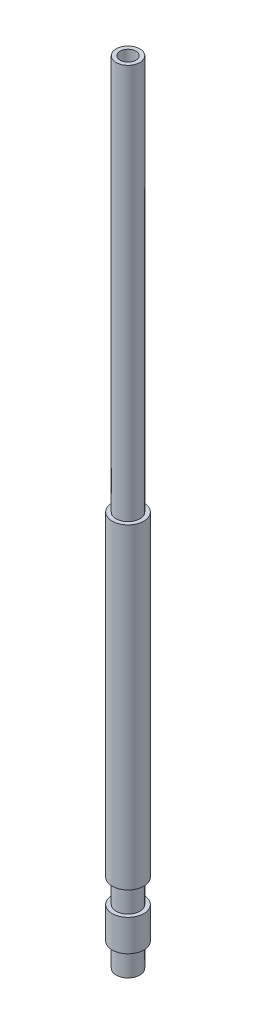
ISO-10303-21;
HEADER;
FILE_DESCRIPTION(('STEP AP214'),'2;1');
FILE_NAME('part.step','',(''),(''),'','','');
FILE_SCHEMA(('AUTOMOTIVE_DESIGN { 1 0 10303 214 1 1 1 1 }'));
ENDSEC;
DATA;
#1=APPLICATION_CONTEXT('core data for automotive mechanical design processes');
#2=APPLICATION_PROTOCOL_DEFINITION('international standard','automotive_design',2000,#1);
#3=PRODUCT_CONTEXT('',#1,'mechanical');
#4=PRODUCT('Part','Part','',(#3));
#5=PRODUCT_RELATED_PRODUCT_CATEGORY('part','',(#4));
#6=PRODUCT_DEFINITION_FORMATION('','',#4);
#7=PRODUCT_DEFINITION_CONTEXT('part definition',#1,'design');
#8=PRODUCT_DEFINITION('design','',#6,#7);
#9=PRODUCT_DEFINITION_SHAPE('','',#8);
#10=(LENGTH_UNIT() NAMED_UNIT(*) SI_UNIT(.MILLI.,.METRE.));
#11=(NAMED_UNIT(*) PLANE_ANGLE_UNIT() SI_UNIT($,.RADIAN.));
#12=(NAMED_UNIT(*) SI_UNIT($,.STERADIAN.) SOLID_ANGLE_UNIT());
#13=UNCERTAINTY_MEASURE_WITH_UNIT(LENGTH_MEASURE(1.E-05),#10,'distance_accuracy_value','');
#14=(GEOMETRIC_REPRESENTATION_CONTEXT(3) GLOBAL_UNCERTAINTY_ASSIGNED_CONTEXT((#13)) GLOBAL_UNIT_ASSIGNED_CONTEXT((#10,
#11,#12)) REPRESENTATION_CONTEXT('',''));
#15=CARTESIAN_POINT('',(0.,0.,0.));
#16=DIRECTION('',(0.,0.,1.));
#17=DIRECTION('',(1.,0.,0.));
#18=AXIS2_PLACEMENT_3D('',#15,#16,#17);
#19=CARTESIAN_POINT('',(0.,100.,0.));
#20=DIRECTION('',(0.,1.,0.));
#21=DIRECTION('',(0.,0.,1.));
#22=AXIS2_PLACEMENT_3D('',#19,#20,#21);
#23=PLANE('',#22);
#24=CARTESIAN_POINT('',(0.,100.,0.));
#25=DIRECTION('',(0.,1.,0.));
#26=DIRECTION('',(0.,0.,1.));
#27=AXIS2_PLACEMENT_3D('',#24,#25,#26);
#28=CIRCLE('',#27,1.);
#29=CARTESIAN_POINT('',(0.,100.,1.));
#30=VERTEX_POINT('',#29);
#31=EDGE_CURVE('E10',#30,#30,#28,.T.);
#32=ORIENTED_EDGE('',*,*,#31,.F.);
#33=EDGE_LOOP('',(#32));
#34=FACE_BOUND('',#33,.T.);
#35=CARTESIAN_POINT('',(0.,100.,0.));
#36=DIRECTION('',(0.,-1.,0.));
#37=DIRECTION('',(0.,0.,-1.));
#38=AXIS2_PLACEMENT_3D('',#35,#36,#37);
#39=CIRCLE('',#38,1.49999999999998);
#40=CARTESIAN_POINT('',(0.,100.,-1.49999999999998));
#41=VERTEX_POINT('',#40);
#42=EDGE_CURVE('E73',#41,#41,#39,.T.);
#43=ORIENTED_EDGE('',*,*,#42,.F.);
#44=EDGE_LOOP('',(#43));
#45=FACE_BOUND('',#44,.T.);
#46=ADVANCED_FACE('F34',(#34,#45),#23,.T.);
#47=CARTESIAN_POINT('',(0.,100.,0.));
#48=DIRECTION('',(0.,-1.,0.));
#49=DIRECTION('',(0.,0.,-1.));
#50=AXIS2_PLACEMENT_3D('',#47,#48,#49);
#51=CYLINDRICAL_SURFACE('',#50,2.);
#52=CARTESIAN_POINT('',(0.,7.,0.));
#53=DIRECTION('',(0.,-1.,0.));
#54=DIRECTION('',(0.,0.,-1.));
#55=AXIS2_PLACEMENT_3D('',#52,#53,#54);
#56=CIRCLE('',#55,2.);
#57=CARTESIAN_POINT('',(0.,7.,-2.));
#58=VERTEX_POINT('',#57);
#59=EDGE_CURVE('E64',#58,#58,#56,.T.);
#60=ORIENTED_EDGE('',*,*,#59,.T.);
#61=EDGE_LOOP('',(#60));
#62=FACE_BOUND('',#61,.T.);
#63=CARTESIAN_POINT('',(0.,3.,0.));
#64=DIRECTION('',(0.,-1.,0.));
#65=DIRECTION('',(0.,0.,-1.));
#66=AXIS2_PLACEMENT_3D('',#63,#64,#65);
#67=CIRCLE('',#66,2.);
#68=CARTESIAN_POINT('',(0.,3.,-2.));
#69=VERTEX_POINT('',#68);
#70=EDGE_CURVE('E45',#69,#69,#67,.T.);
#71=ORIENTED_EDGE('',*,*,#70,.F.);
#72=EDGE_LOOP('',(#71));
#73=FACE_BOUND('',#72,.T.);
#74=ADVANCED_FACE('F80',(#62,#73),#51,.T.);
#75=CARTESIAN_POINT('',(0.,0.,0.));
#76=DIRECTION('',(0.,1.,0.));
#77=DIRECTION('',(0.,0.,1.));
#78=AXIS2_PLACEMENT_3D('',#75,#76,#77);
#79=PLANE('',#78);
#80=CARTESIAN_POINT('',(0.,0.,0.));
#81=DIRECTION('',(0.,1.,0.));
#82=DIRECTION('',(0.,0.,1.));
#83=AXIS2_PLACEMENT_3D('',#80,#81,#82);
#84=CIRCLE('',#83,1.);
#85=CARTESIAN_POINT('',(0.,0.,1.));
#86=VERTEX_POINT('',#85);
#87=EDGE_CURVE('E38',#86,#86,#84,.T.);
#88=ORIENTED_EDGE('',*,*,#87,.T.);
#89=EDGE_LOOP('',(#88));
#90=FACE_BOUND('',#89,.T.);
#91=CARTESIAN_POINT('',(0.,0.,0.));
#92=DIRECTION('',(0.,-1.,0.));
#93=DIRECTION('',(0.,0.,-1.));
#94=AXIS2_PLACEMENT_3D('',#91,#92,#93);
#95=CIRCLE('',#94,1.5);
#96=CARTESIAN_POINT('',(0.,0.,-1.5));
#97=VERTEX_POINT('',#96);
#98=EDGE_CURVE('E52',#97,#97,#95,.T.);
#99=ORIENTED_EDGE('',*,*,#98,.T.);
#100=EDGE_LOOP('',(#99));
#101=FACE_BOUND('',#100,.T.);
#102=ADVANCED_FACE('F86',(#90,#101),#79,.F.);
#103=CARTESIAN_POINT('',(0.,50.,0.));
#104=DIRECTION('',(0.,-1.,0.));
#105=DIRECTION('',(0.,0.,-1.));
#106=AXIS2_PLACEMENT_3D('',#103,#104,#105);
#107=CIRCLE('',#106,2.00000000000001);
#108=CARTESIAN_POINT('',(0.,50.,-2.00000000000001));
#109=VERTEX_POINT('',#108);
#110=EDGE_CURVE('E67',#109,#109,#107,.T.);
#111=ORIENTED_EDGE('',*,*,#110,.T.);
#112=EDGE_LOOP('',(#111));
#113=FACE_BOUND('',#112,.T.);
#114=CARTESIAN_POINT('',(0.,10.,0.));
#115=DIRECTION('',(0.,-1.,0.));
#116=DIRECTION('',(0.,0.,-1.));
#117=AXIS2_PLACEMENT_3D('',#114,#115,#116);
#118=CIRCLE('',#117,2.);
#119=CARTESIAN_POINT('',(0.,10.,-2.));
#120=VERTEX_POINT('',#119);
#121=EDGE_CURVE('E61',#120,#120,#118,.T.);
#122=ORIENTED_EDGE('',*,*,#121,.F.);
#123=EDGE_LOOP('',(#122));
#124=FACE_BOUND('',#123,.T.);
#125=ADVANCED_FACE('F36',(#113,#124),#51,.T.);
#126=CARTESIAN_POINT('',(0.,100.,0.));
#127=DIRECTION('',(0.,-1.,0.));
#128=DIRECTION('',(0.,0.,-1.));
#129=AXIS2_PLACEMENT_3D('',#126,#127,#128);
#130=CYLINDRICAL_SURFACE('',#129,1.);
#131=ORIENTED_EDGE('',*,*,#31,.T.);
#132=EDGE_LOOP('',(#131));
#133=FACE_BOUND('',#132,.T.);
#134=ORIENTED_EDGE('',*,*,#87,.F.);
#135=EDGE_LOOP('',(#134));
#136=FACE_BOUND('',#135,.T.);
#137=ADVANCED_FACE('F89',(#133,#136),#130,.F.);
#138=CARTESIAN_POINT('',(2.,3.,0.));
#139=DIRECTION('',(0.,1.,0.));
#140=DIRECTION('',(0.,0.,1.));
#141=AXIS2_PLACEMENT_3D('',#138,#139,#140);
#142=PLANE('',#141);
#143=CARTESIAN_POINT('',(0.,3.,0.));
#144=DIRECTION('',(0.,-1.,0.));
#145=DIRECTION('',(0.,0.,-1.));
#146=AXIS2_PLACEMENT_3D('',#143,#144,#145);
#147=CIRCLE('',#146,1.5);
#148=CARTESIAN_POINT('',(0.,3.,-1.5));
#149=VERTEX_POINT('',#148);
#150=EDGE_CURVE('E49',#149,#149,#147,.T.);
#151=ORIENTED_EDGE('',*,*,#150,.F.);
#152=EDGE_LOOP('',(#151));
#153=FACE_BOUND('',#152,.T.);
#154=ORIENTED_EDGE('',*,*,#70,.T.);
#155=EDGE_LOOP('',(#154));
#156=FACE_BOUND('',#155,.T.);
#157=ADVANCED_FACE('F105',(#153,#156),#142,.F.);
#158=CARTESIAN_POINT('',(0.,0.,0.));
#159=DIRECTION('',(0.,-1.,0.));
#160=DIRECTION('',(0.,0.,-1.));
#161=AXIS2_PLACEMENT_3D('',#158,#159,#160);
#162=CYLINDRICAL_SURFACE('',#161,1.5);
#163=ORIENTED_EDGE('',*,*,#98,.F.);
#164=EDGE_LOOP('',(#163));
#165=FACE_BOUND('',#164,.T.);
#166=ORIENTED_EDGE('',*,*,#150,.T.);
#167=EDGE_LOOP('',(#166));
#168=FACE_BOUND('',#167,.T.);
#169=ADVANCED_FACE('F101',(#165,#168),#162,.T.);
#170=CARTESIAN_POINT('',(2.,7.,0.));
#171=DIRECTION('',(0.,-1.,0.));
#172=DIRECTION('',(0.,0.,-1.));
#173=AXIS2_PLACEMENT_3D('',#170,#171,#172);
#174=PLANE('',#173);
#175=ORIENTED_EDGE('',*,*,#59,.F.);
#176=EDGE_LOOP('',(#175));
#177=FACE_BOUND('',#176,.T.);
#178=CARTESIAN_POINT('',(0.,7.,0.));
#179=DIRECTION('',(0.,-1.,0.));
#180=DIRECTION('',(0.,0.,-1.));
#181=AXIS2_PLACEMENT_3D('',#178,#179,#180);
#182=CIRCLE('',#181,1.5);
#183=CARTESIAN_POINT('',(0.,7.,-1.5));
#184=VERTEX_POINT('',#183);
#185=EDGE_CURVE('E55',#184,#184,#182,.T.);
#186=ORIENTED_EDGE('',*,*,#185,.T.);
#187=EDGE_LOOP('',(#186));
#188=FACE_BOUND('',#187,.T.);
#189=ADVANCED_FACE('F104',(#177,#188),#174,.F.);
#190=CARTESIAN_POINT('',(0.,0.,0.));
#191=DIRECTION('',(0.,-1.,0.));
#192=DIRECTION('',(0.,0.,-1.));
#193=AXIS2_PLACEMENT_3D('',#190,#191,#192);
#194=CYLINDRICAL_SURFACE('',#193,1.5);
#195=ORIENTED_EDGE('',*,*,#185,.F.);
#196=EDGE_LOOP('',(#195));
#197=FACE_BOUND('',#196,.T.);
#198=CARTESIAN_POINT('',(0.,10.,0.));
#199=DIRECTION('',(0.,-1.,0.));
#200=DIRECTION('',(0.,0.,-1.));
#201=AXIS2_PLACEMENT_3D('',#198,#199,#200);
#202=CIRCLE('',#201,1.5);
#203=CARTESIAN_POINT('',(0.,10.,-1.5));
#204=VERTEX_POINT('',#203);
#205=EDGE_CURVE('E58',#204,#204,#202,.T.);
#206=ORIENTED_EDGE('',*,*,#205,.T.);
#207=EDGE_LOOP('',(#206));
#208=FACE_BOUND('',#207,.T.);
#209=ADVANCED_FACE('F119',(#197,#208),#194,.T.);
#210=CARTESIAN_POINT('',(2.,10.,0.));
#211=DIRECTION('',(0.,1.,0.));
#212=DIRECTION('',(0.,0.,1.));
#213=AXIS2_PLACEMENT_3D('',#210,#211,#212);
#214=PLANE('',#213);
#215=ORIENTED_EDGE('',*,*,#205,.F.);
#216=EDGE_LOOP('',(#215));
#217=FACE_BOUND('',#216,.T.);
#218=ORIENTED_EDGE('',*,*,#121,.T.);
#219=EDGE_LOOP('',(#218));
#220=FACE_BOUND('',#219,.T.);
#221=ADVANCED_FACE('F123',(#217,#220),#214,.F.);
#222=CARTESIAN_POINT('',(2.00000000000001,50.,0.));
#223=DIRECTION('',(0.,-1.,0.));
#224=DIRECTION('',(0.,0.,-1.));
#225=AXIS2_PLACEMENT_3D('',#222,#223,#224);
#226=PLANE('',#225);
#227=ORIENTED_EDGE('',*,*,#110,.F.);
#228=EDGE_LOOP('',(#227));
#229=FACE_BOUND('',#228,.T.);
#230=CARTESIAN_POINT('',(0.,50.,0.));
#231=DIRECTION('',(0.,-1.,0.));
#232=DIRECTION('',(0.,0.,-1.));
#233=AXIS2_PLACEMENT_3D('',#230,#231,#232);
#234=CIRCLE('',#233,1.50000000000001);
#235=CARTESIAN_POINT('',(0.,50.,-1.50000000000001));
#236=VERTEX_POINT('',#235);
#237=EDGE_CURVE('E70',#236,#236,#234,.T.);
#238=ORIENTED_EDGE('',*,*,#237,.T.);
#239=EDGE_LOOP('',(#238));
#240=FACE_BOUND('',#239,.T.);
#241=ADVANCED_FACE('F127',(#229,#240),#226,.F.);
#242=CARTESIAN_POINT('',(0.,0.,0.));
#243=DIRECTION('',(0.,-1.,0.));
#244=DIRECTION('',(0.,0.,-1.));
#245=AXIS2_PLACEMENT_3D('',#242,#243,#244);
#246=CYLINDRICAL_SURFACE('',#245,1.49999999999999);
#247=ORIENTED_EDGE('',*,*,#237,.F.);
#248=EDGE_LOOP('',(#247));
#249=FACE_BOUND('',#248,.T.);
#250=ORIENTED_EDGE('',*,*,#42,.T.);
#251=EDGE_LOOP('',(#250));
#252=FACE_BOUND('',#251,.T.);
#253=ADVANCED_FACE('F77',(#249,#252),#246,.T.);
#254=CLOSED_SHELL('',(#46,#74,#102,#125,#137,#157,#169,#189,#209,#221,#241,#253));
#255=MANIFOLD_SOLID_BREP('B2',#254);
#256=ADVANCED_BREP_SHAPE_REPRESENTATION('',(#18,#255),#14);
#257=SHAPE_DEFINITION_REPRESENTATION(#9,#256);
ENDSEC;
END-ISO-10303-21;
